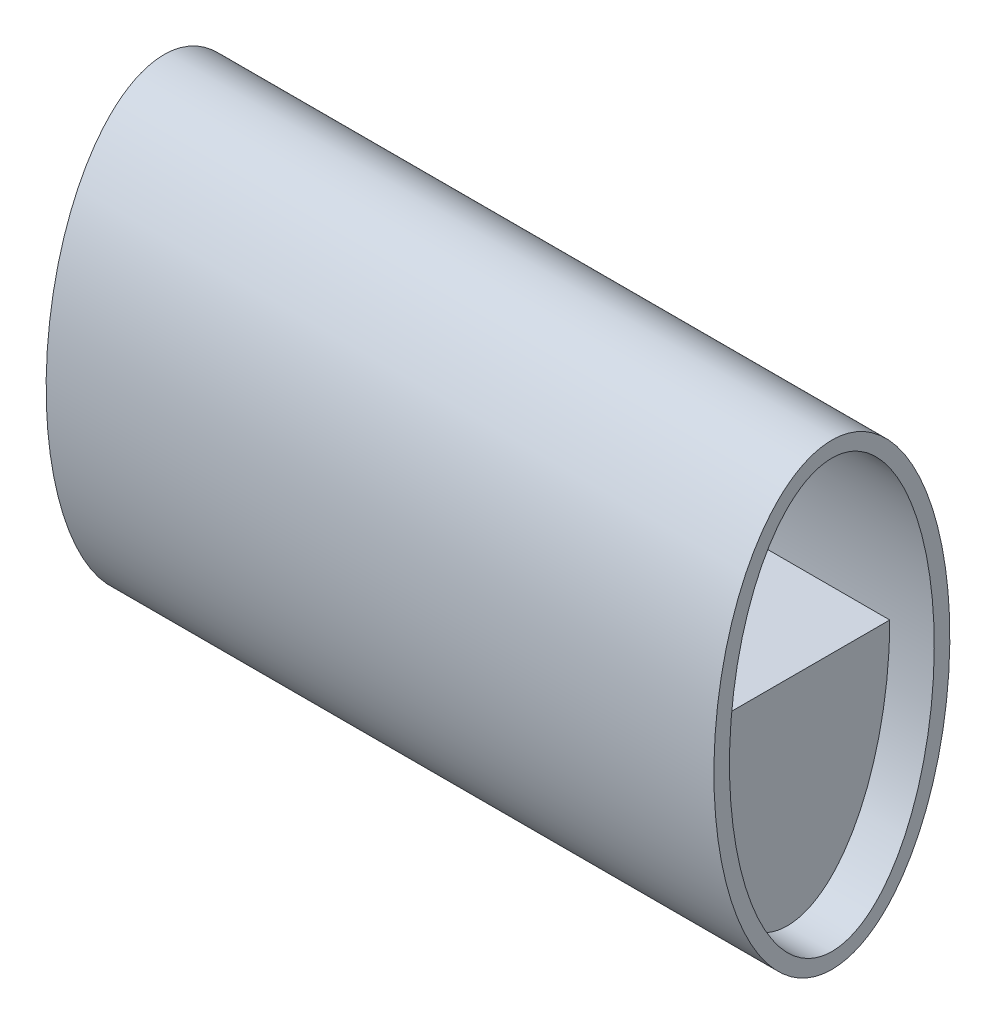
ISO-10303-21;
HEADER;
FILE_DESCRIPTION(('STEP AP214'),'2;1');
FILE_NAME('part.step','',(''),(''),'','','');
FILE_SCHEMA(('AUTOMOTIVE_DESIGN { 1 0 10303 214 1 1 1 1 }'));
ENDSEC;
DATA;
#1=APPLICATION_CONTEXT('core data for automotive mechanical design processes');
#2=APPLICATION_PROTOCOL_DEFINITION('international standard','automotive_design',2000,#1);
#3=PRODUCT_CONTEXT('',#1,'mechanical');
#4=PRODUCT('Part','Part','',(#3));
#5=PRODUCT_RELATED_PRODUCT_CATEGORY('part','',(#4));
#6=PRODUCT_DEFINITION_FORMATION('','',#4);
#7=PRODUCT_DEFINITION_CONTEXT('part definition',#1,'design');
#8=PRODUCT_DEFINITION('design','',#6,#7);
#9=PRODUCT_DEFINITION_SHAPE('','',#8);
#10=(LENGTH_UNIT() NAMED_UNIT(*) SI_UNIT(.MILLI.,.METRE.));
#11=(NAMED_UNIT(*) PLANE_ANGLE_UNIT() SI_UNIT($,.RADIAN.));
#12=(NAMED_UNIT(*) SI_UNIT($,.STERADIAN.) SOLID_ANGLE_UNIT());
#13=UNCERTAINTY_MEASURE_WITH_UNIT(LENGTH_MEASURE(1.E-05),#10,'distance_accuracy_value','');
#14=(GEOMETRIC_REPRESENTATION_CONTEXT(3) GLOBAL_UNCERTAINTY_ASSIGNED_CONTEXT((#13)) GLOBAL_UNIT_ASSIGNED_CONTEXT((#10,
#11,#12)) REPRESENTATION_CONTEXT('',''));
#15=CARTESIAN_POINT('',(0.,0.,0.));
#16=DIRECTION('',(0.,0.,1.));
#17=DIRECTION('',(1.,0.,0.));
#18=AXIS2_PLACEMENT_3D('',#15,#16,#17);
#19=CARTESIAN_POINT('',(300.,0.,0.));
#20=DIRECTION('',(1.,0.,0.));
#21=DIRECTION('',(0.,-1.,0.));
#22=AXIS2_PLACEMENT_3D('',#19,#20,#21);
#23=ELLIPSE('',#22,96.,46.);
#24=DIRECTION('',(-1.,0.,0.));
#25=VECTOR('',#24,1.);
#26=SURFACE_OF_LINEAR_EXTRUSION('',#23,#25);
#27=CARTESIAN_POINT('',(300.,-96.,-1.49064673172889E-13));
#28=VERTEX_POINT('',#27);
#29=EDGE_CURVE('E138',#28,#28,#23,.T.);
#30=ORIENTED_EDGE('',*,*,#29,.T.);
#31=EDGE_LOOP('',(#30));
#32=FACE_BOUND('',#31,.T.);
#33=CARTESIAN_POINT('',(180.,0.,0.));
#34=DIRECTION('',(-1.,0.,0.));
#35=DIRECTION('',(0.,-1.,0.));
#36=AXIS2_PLACEMENT_3D('',#33,#34,#35);
#37=ELLIPSE('',#36,96.,46.);
#38=CARTESIAN_POINT('',(180.,0.,46.));
#39=VERTEX_POINT('',#38);
#40=CARTESIAN_POINT('',(180.,0.,-46.));
#41=VERTEX_POINT('',#40);
#42=EDGE_CURVE('E109',#39,#41,#37,.T.);
#43=ORIENTED_EDGE('',*,*,#42,.T.);
#44=DIRECTION('',(-1.,0.,0.));
#45=VECTOR('',#44,1.);
#46=CARTESIAN_POINT('',(432.966161108757,0.,-46.));
#47=LINE('',#46,#45);
#48=CARTESIAN_POINT('',(280.,0.,-46.));
#49=VERTEX_POINT('',#48);
#50=EDGE_CURVE('E64',#49,#41,#47,.T.);
#51=ORIENTED_EDGE('',*,*,#50,.F.);
#52=CARTESIAN_POINT('',(280.,0.,0.));
#53=DIRECTION('',(1.,0.,0.));
#54=DIRECTION('',(0.,-1.,0.));
#55=AXIS2_PLACEMENT_3D('',#52,#53,#54);
#56=ELLIPSE('',#55,96.,46.);
#57=CARTESIAN_POINT('',(280.,0.,46.));
#58=VERTEX_POINT('',#57);
#59=EDGE_CURVE('E172',#58,#49,#56,.T.);
#60=ORIENTED_EDGE('',*,*,#59,.F.);
#61=DIRECTION('',(-1.,0.,0.));
#62=VECTOR('',#61,1.);
#63=CARTESIAN_POINT('',(432.966161108757,0.,46.));
#64=LINE('',#63,#62);
#65=EDGE_CURVE('E168',#58,#39,#64,.T.);
#66=ORIENTED_EDGE('',*,*,#65,.T.);
#67=EDGE_LOOP('',(#43,#51,#60,#66));
#68=FACE_BOUND('',#67,.T.);
#69=ADVANCED_FACE('F40',(#32,#68),#26,.T.);
#70=CARTESIAN_POINT('',(180.,0.,0.));
#71=DIRECTION('',(-1.,0.,0.));
#72=DIRECTION('',(0.,0.,1.));
#73=AXIS2_PLACEMENT_3D('',#70,#71,#72);
#74=PLANE('',#73);
#75=DIRECTION('',(0.,0.,1.));
#76=VECTOR('',#75,1.);
#77=CARTESIAN_POINT('',(180.,0.,46.));
#78=LINE('',#77,#76);
#79=EDGE_CURVE('E198',#41,#39,#78,.T.);
#80=ORIENTED_EDGE('',*,*,#79,.F.);
#81=ORIENTED_EDGE('',*,*,#42,.F.);
#82=EDGE_LOOP('',(#80,#81));
#83=FACE_BOUND('',#82,.T.);
#84=ADVANCED_FACE('F131',(#83),#74,.F.);
#85=CARTESIAN_POINT('',(0.,0.,0.));
#86=DIRECTION('',(1.,0.,0.));
#87=DIRECTION('',(0.,-1.,0.));
#88=AXIS2_PLACEMENT_3D('',#85,#86,#87);
#89=ELLIPSE('',#88,96.,46.);
#90=CARTESIAN_POINT('',(0.,-96.,-1.49064673172889E-13));
#91=VERTEX_POINT('',#90);
#92=EDGE_CURVE('E112',#91,#91,#89,.T.);
#93=ORIENTED_EDGE('',*,*,#92,.F.);
#94=EDGE_LOOP('',(#93));
#95=FACE_BOUND('',#94,.T.);
#96=CARTESIAN_POINT('',(20.,0.,0.));
#97=DIRECTION('',(-1.,0.,0.));
#98=DIRECTION('',(0.,-1.,0.));
#99=AXIS2_PLACEMENT_3D('',#96,#97,#98);
#100=ELLIPSE('',#99,96.,46.);
#101=CARTESIAN_POINT('',(20.,0.,46.));
#102=VERTEX_POINT('',#101);
#103=CARTESIAN_POINT('',(20.,0.,-46.));
#104=VERTEX_POINT('',#103);
#105=EDGE_CURVE('E114',#102,#104,#100,.F.);
#106=ORIENTED_EDGE('',*,*,#105,.T.);
#107=DIRECTION('',(1.,0.,0.));
#108=VECTOR('',#107,1.);
#109=CARTESIAN_POINT('',(-132.966161108757,0.,-46.));
#110=LINE('',#109,#108);
#111=CARTESIAN_POINT('',(120.,0.,-46.));
#112=VERTEX_POINT('',#111);
#113=EDGE_CURVE('E160',#104,#112,#110,.T.);
#114=ORIENTED_EDGE('',*,*,#113,.T.);
#115=CARTESIAN_POINT('',(120.,0.,0.));
#116=DIRECTION('',(1.,0.,0.));
#117=DIRECTION('',(0.,-1.,0.));
#118=AXIS2_PLACEMENT_3D('',#115,#116,#117);
#119=ELLIPSE('',#118,96.,46.);
#120=CARTESIAN_POINT('',(120.,0.,46.));
#121=VERTEX_POINT('',#120);
#122=EDGE_CURVE('E12',#121,#112,#119,.F.);
#123=ORIENTED_EDGE('',*,*,#122,.F.);
#124=DIRECTION('',(1.,0.,0.));
#125=VECTOR('',#124,1.);
#126=CARTESIAN_POINT('',(-132.966161108757,0.,46.));
#127=LINE('',#126,#125);
#128=EDGE_CURVE('E161',#102,#121,#127,.T.);
#129=ORIENTED_EDGE('',*,*,#128,.F.);
#130=EDGE_LOOP('',(#106,#114,#123,#129));
#131=FACE_BOUND('',#130,.T.);
#132=ADVANCED_FACE('F129',(#95,#131),#26,.T.);
#133=CARTESIAN_POINT('',(120.,0.,0.));
#134=DIRECTION('',(-1.,0.,0.));
#135=DIRECTION('',(0.,0.,1.));
#136=AXIS2_PLACEMENT_3D('',#133,#134,#135);
#137=PLANE('',#136);
#138=ORIENTED_EDGE('',*,*,#122,.T.);
#139=DIRECTION('',(0.,0.,-1.));
#140=VECTOR('',#139,1.);
#141=CARTESIAN_POINT('',(120.,0.,-46.));
#142=LINE('',#141,#140);
#143=EDGE_CURVE('E170',#121,#112,#142,.T.);
#144=ORIENTED_EDGE('',*,*,#143,.F.);
#145=EDGE_LOOP('',(#138,#144));
#146=FACE_BOUND('',#145,.T.);
#147=ADVANCED_FACE('F125',(#146),#137,.T.);
#148=CARTESIAN_POINT('',(300.,0.,0.));
#149=DIRECTION('',(1.,0.,0.));
#150=DIRECTION('',(0.,0.,-1.));
#151=AXIS2_PLACEMENT_3D('',#148,#149,#150);
#152=PLANE('',#151);
#153=CARTESIAN_POINT('',(300.,0.,0.));
#154=DIRECTION('',(1.,0.,0.));
#155=DIRECTION('',(0.,-1.,0.));
#156=AXIS2_PLACEMENT_3D('',#153,#154,#155);
#157=ELLIPSE('',#156,103.,53.);
#158=CARTESIAN_POINT('',(300.,-103.,0.));
#159=VERTEX_POINT('',#158);
#160=EDGE_CURVE('E49',#159,#159,#157,.T.);
#161=ORIENTED_EDGE('',*,*,#160,.T.);
#162=EDGE_LOOP('',(#161));
#163=FACE_BOUND('',#162,.T.);
#164=ORIENTED_EDGE('',*,*,#29,.F.);
#165=EDGE_LOOP('',(#164));
#166=FACE_BOUND('',#165,.T.);
#167=ADVANCED_FACE('F128',(#163,#166),#152,.T.);
#168=CARTESIAN_POINT('',(0.,0.,0.));
#169=DIRECTION('',(1.,0.,0.));
#170=DIRECTION('',(0.,0.,-1.));
#171=AXIS2_PLACEMENT_3D('',#168,#169,#170);
#172=PLANE('',#171);
#173=CARTESIAN_POINT('',(0.,0.,0.));
#174=DIRECTION('',(1.,0.,0.));
#175=DIRECTION('',(0.,-1.,0.));
#176=AXIS2_PLACEMENT_3D('',#173,#174,#175);
#177=ELLIPSE('',#176,103.,53.);
#178=CARTESIAN_POINT('',(0.,-103.,0.));
#179=VERTEX_POINT('',#178);
#180=EDGE_CURVE('E142',#179,#179,#177,.T.);
#181=ORIENTED_EDGE('',*,*,#180,.F.);
#182=EDGE_LOOP('',(#181));
#183=FACE_BOUND('',#182,.T.);
#184=ORIENTED_EDGE('',*,*,#92,.T.);
#185=EDGE_LOOP('',(#184));
#186=FACE_BOUND('',#185,.T.);
#187=ADVANCED_FACE('F150',(#183,#186),#172,.F.);
#188=DIRECTION('',(-1.,0.,0.));
#189=VECTOR('',#188,1.);
#190=SURFACE_OF_LINEAR_EXTRUSION('',#157,#189);
#191=ORIENTED_EDGE('',*,*,#160,.F.);
#192=EDGE_LOOP('',(#191));
#193=FACE_BOUND('',#192,.T.);
#194=ORIENTED_EDGE('',*,*,#180,.T.);
#195=EDGE_LOOP('',(#194));
#196=FACE_BOUND('',#195,.T.);
#197=ADVANCED_FACE('F42',(#193,#196),#190,.F.);
#198=CARTESIAN_POINT('',(-132.966161108757,0.,-46.));
#199=DIRECTION('',(0.,-1.,0.));
#200=DIRECTION('',(0.,0.,-1.));
#201=AXIS2_PLACEMENT_3D('',#198,#199,#200);
#202=PLANE('',#201);
#203=ORIENTED_EDGE('',*,*,#113,.F.);
#204=DIRECTION('',(0.,0.,1.));
#205=VECTOR('',#204,1.);
#206=CARTESIAN_POINT('',(20.,0.,-46.));
#207=LINE('',#206,#205);
#208=EDGE_CURVE('E164',#104,#102,#207,.T.);
#209=ORIENTED_EDGE('',*,*,#208,.T.);
#210=ORIENTED_EDGE('',*,*,#128,.T.);
#211=ORIENTED_EDGE('',*,*,#143,.T.);
#212=EDGE_LOOP('',(#203,#209,#210,#211));
#213=FACE_BOUND('',#212,.T.);
#214=ADVANCED_FACE('F176',(#213),#202,.F.);
#215=CARTESIAN_POINT('',(20.,0.,0.));
#216=DIRECTION('',(1.,0.,0.));
#217=DIRECTION('',(0.,0.,-1.));
#218=AXIS2_PLACEMENT_3D('',#215,#216,#217);
#219=PLANE('',#218);
#220=ORIENTED_EDGE('',*,*,#208,.F.);
#221=ORIENTED_EDGE('',*,*,#105,.F.);
#222=EDGE_LOOP('',(#220,#221));
#223=FACE_BOUND('',#222,.T.);
#224=ADVANCED_FACE('F177',(#223),#219,.F.);
#225=CARTESIAN_POINT('',(432.966161108757,0.,46.));
#226=DIRECTION('',(0.,-1.,0.));
#227=DIRECTION('',(0.,0.,-1.));
#228=AXIS2_PLACEMENT_3D('',#225,#226,#227);
#229=PLANE('',#228);
#230=DIRECTION('',(0.,0.,1.));
#231=VECTOR('',#230,1.);
#232=CARTESIAN_POINT('',(280.,0.,46.));
#233=LINE('',#232,#231);
#234=EDGE_CURVE('E200',#49,#58,#233,.T.);
#235=ORIENTED_EDGE('',*,*,#234,.F.);
#236=ORIENTED_EDGE('',*,*,#50,.T.);
#237=ORIENTED_EDGE('',*,*,#79,.T.);
#238=ORIENTED_EDGE('',*,*,#65,.F.);
#239=EDGE_LOOP('',(#235,#236,#237,#238));
#240=FACE_BOUND('',#239,.T.);
#241=ADVANCED_FACE('F179',(#240),#229,.F.);
#242=CARTESIAN_POINT('',(280.,0.,0.));
#243=DIRECTION('',(1.,0.,0.));
#244=DIRECTION('',(0.,0.,-1.));
#245=AXIS2_PLACEMENT_3D('',#242,#243,#244);
#246=PLANE('',#245);
#247=ORIENTED_EDGE('',*,*,#234,.T.);
#248=ORIENTED_EDGE('',*,*,#59,.T.);
#249=EDGE_LOOP('',(#247,#248));
#250=FACE_BOUND('',#249,.T.);
#251=ADVANCED_FACE('F185',(#250),#246,.T.);
#252=CLOSED_SHELL('',(#69,#84,#132,#147,#167,#187,#197,#214,#224,#241,#251));
#253=CARTESIAN_POINT('',(123.,0.,0.));
#254=DIRECTION('',(-1.,0.,0.));
#255=DIRECTION('',(0.,1.,0.));
#256=AXIS2_PLACEMENT_3D('',#253,#254,#255);
#257=ELLIPSE('',#256,96.,46.);
#258=DIRECTION('',(1.,0.,0.));
#259=VECTOR('',#258,1.);
#260=SURFACE_OF_LINEAR_EXTRUSION('',#257,#259);
#261=CARTESIAN_POINT('',(177.,0.,0.));
#262=DIRECTION('',(-1.,0.,0.));
#263=DIRECTION('',(0.,1.,0.));
#264=AXIS2_PLACEMENT_3D('',#261,#262,#263);
#265=ELLIPSE('',#264,96.,46.);
#266=CARTESIAN_POINT('',(177.,0.,46.));
#267=VERTEX_POINT('',#266);
#268=CARTESIAN_POINT('',(177.,0.,-46.));
#269=VERTEX_POINT('',#268);
#270=EDGE_CURVE('E110',#267,#269,#265,.T.);
#271=ORIENTED_EDGE('',*,*,#270,.F.);
#272=DIRECTION('',(-1.,0.,0.));
#273=VECTOR('',#272,1.);
#274=CARTESIAN_POINT('',(309.966161108757,0.,46.));
#275=LINE('',#274,#273);
#276=CARTESIAN_POINT('',(123.,0.,46.));
#277=VERTEX_POINT('',#276);
#278=EDGE_CURVE('E56',#267,#277,#275,.T.);
#279=ORIENTED_EDGE('',*,*,#278,.T.);
#280=CARTESIAN_POINT('',(123.,0.,-46.));
#281=VERTEX_POINT('',#280);
#282=EDGE_CURVE('E106',#277,#281,#257,.T.);
#283=ORIENTED_EDGE('',*,*,#282,.T.);
#284=DIRECTION('',(-1.,0.,0.));
#285=VECTOR('',#284,1.);
#286=CARTESIAN_POINT('',(309.966161108757,0.,-46.));
#287=LINE('',#286,#285);
#288=EDGE_CURVE('E93',#269,#281,#287,.T.);
#289=ORIENTED_EDGE('',*,*,#288,.F.);
#290=EDGE_LOOP('',(#271,#279,#283,#289));
#291=FACE_BOUND('',#290,.T.);
#292=ADVANCED_FACE('F108',(#291),#260,.T.);
#293=CARTESIAN_POINT('',(123.,0.,0.));
#294=DIRECTION('',(-1.,0.,0.));
#295=DIRECTION('',(0.,0.,1.));
#296=AXIS2_PLACEMENT_3D('',#293,#294,#295);
#297=PLANE('',#296);
#298=DIRECTION('',(0.,0.,1.));
#299=VECTOR('',#298,1.);
#300=CARTESIAN_POINT('',(123.,0.,46.));
#301=LINE('',#300,#299);
#302=EDGE_CURVE('E96',#281,#277,#301,.T.);
#303=ORIENTED_EDGE('',*,*,#302,.F.);
#304=ORIENTED_EDGE('',*,*,#282,.F.);
#305=EDGE_LOOP('',(#303,#304));
#306=FACE_BOUND('',#305,.T.);
#307=ADVANCED_FACE('F105',(#306),#297,.F.);
#308=CARTESIAN_POINT('',(177.,0.,0.));
#309=DIRECTION('',(-1.,0.,0.));
#310=DIRECTION('',(0.,0.,1.));
#311=AXIS2_PLACEMENT_3D('',#308,#309,#310);
#312=PLANE('',#311);
#313=ORIENTED_EDGE('',*,*,#270,.T.);
#314=DIRECTION('',(0.,0.,-1.));
#315=VECTOR('',#314,1.);
#316=CARTESIAN_POINT('',(177.,0.,46.));
#317=LINE('',#316,#315);
#318=EDGE_CURVE('E97',#267,#269,#317,.T.);
#319=ORIENTED_EDGE('',*,*,#318,.F.);
#320=EDGE_LOOP('',(#313,#319));
#321=FACE_BOUND('',#320,.T.);
#322=ADVANCED_FACE('F213',(#321),#312,.T.);
#323=CARTESIAN_POINT('',(309.966161108757,0.,46.));
#324=DIRECTION('',(0.,-1.,0.));
#325=DIRECTION('',(0.,0.,-1.));
#326=AXIS2_PLACEMENT_3D('',#323,#324,#325);
#327=PLANE('',#326);
#328=ORIENTED_EDGE('',*,*,#278,.F.);
#329=ORIENTED_EDGE('',*,*,#318,.T.);
#330=ORIENTED_EDGE('',*,*,#288,.T.);
#331=ORIENTED_EDGE('',*,*,#302,.T.);
#332=EDGE_LOOP('',(#328,#329,#330,#331));
#333=FACE_BOUND('',#332,.T.);
#334=ADVANCED_FACE('F95',(#333),#327,.F.);
#335=CLOSED_SHELL('',(#292,#307,#322,#334));
#336=ORIENTED_CLOSED_SHELL('',*,#335,.T.);
#337=BREP_WITH_VOIDS('B2',#252,(#336));
#338=ADVANCED_BREP_SHAPE_REPRESENTATION('',(#18,#337),#14);
#339=SHAPE_DEFINITION_REPRESENTATION(#9,#338);
ENDSEC;
END-ISO-10303-21;
